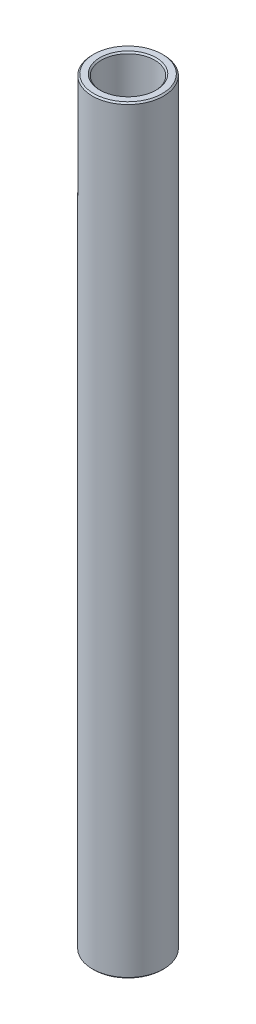
ISO-10303-21;
HEADER;
FILE_DESCRIPTION(('STEP AP214'),'2;1');
FILE_NAME('part.step','',(''),(''),'','','');
FILE_SCHEMA(('AUTOMOTIVE_DESIGN { 1 0 10303 214 1 1 1 1 }'));
ENDSEC;
DATA;
#1=APPLICATION_CONTEXT('core data for automotive mechanical design processes');
#2=APPLICATION_PROTOCOL_DEFINITION('international standard','automotive_design',2000,#1);
#3=PRODUCT_CONTEXT('',#1,'mechanical');
#4=PRODUCT('Part','Part','',(#3));
#5=PRODUCT_RELATED_PRODUCT_CATEGORY('part','',(#4));
#6=PRODUCT_DEFINITION_FORMATION('','',#4);
#7=PRODUCT_DEFINITION_CONTEXT('part definition',#1,'design');
#8=PRODUCT_DEFINITION('design','',#6,#7);
#9=PRODUCT_DEFINITION_SHAPE('','',#8);
#10=(LENGTH_UNIT() NAMED_UNIT(*) SI_UNIT(.MILLI.,.METRE.));
#11=(NAMED_UNIT(*) PLANE_ANGLE_UNIT() SI_UNIT($,.RADIAN.));
#12=(NAMED_UNIT(*) SI_UNIT($,.STERADIAN.) SOLID_ANGLE_UNIT());
#13=UNCERTAINTY_MEASURE_WITH_UNIT(LENGTH_MEASURE(1.E-05),#10,'distance_accuracy_value','');
#14=(GEOMETRIC_REPRESENTATION_CONTEXT(3) GLOBAL_UNCERTAINTY_ASSIGNED_CONTEXT((#13)) GLOBAL_UNIT_ASSIGNED_CONTEXT((#10,
#11,#12)) REPRESENTATION_CONTEXT('',''));
#15=CARTESIAN_POINT('',(0.,0.,0.));
#16=DIRECTION('',(0.,0.,1.));
#17=DIRECTION('',(1.,0.,0.));
#18=AXIS2_PLACEMENT_3D('',#15,#16,#17);
#19=CARTESIAN_POINT('',(6.35000000000029,70.6436949648132,0.));
#20=DIRECTION('',(-1.0081291598624E-12,-1.,0.));
#21=DIRECTION('',(1.,-1.0081291598624E-12,0.));
#22=AXIS2_PLACEMENT_3D('',#19,#20,#21);
#23=PLANE('',#22);
#24=CARTESIAN_POINT('',(9.60243024769503E-12,70.6436949648196,0.));
#25=DIRECTION('',(-1.0081291598624E-12,-1.,0.));
#26=DIRECTION('',(1.,-1.0081291598624E-12,0.));
#27=AXIS2_PLACEMENT_3D('',#24,#25,#26);
#28=CIRCLE('',#27,5.01649999998959);
#29=CARTESIAN_POINT('',(5.01649999999919,70.6436949648146,0.));
#30=VERTEX_POINT('',#29);
#31=EDGE_CURVE('E10',#30,#30,#28,.F.);
#32=ORIENTED_EDGE('',*,*,#31,.T.);
#33=EDGE_LOOP('',(#32));
#34=FACE_BOUND('',#33,.T.);
#35=CARTESIAN_POINT('',(9.60243024769503E-12,70.6436949648196,0.));
#36=DIRECTION('',(-1.0081291598624E-12,-1.,0.));
#37=DIRECTION('',(1.,-1.0081291598624E-12,0.));
#38=AXIS2_PLACEMENT_3D('',#35,#36,#37);
#39=CIRCLE('',#38,6.09599999998992);
#40=CARTESIAN_POINT('',(6.09599999999952,70.6436949648135,0.));
#41=VERTEX_POINT('',#40);
#42=EDGE_CURVE('E37',#41,#41,#39,.T.);
#43=ORIENTED_EDGE('',*,*,#42,.T.);
#44=EDGE_LOOP('',(#43));
#45=FACE_BOUND('',#44,.T.);
#46=ADVANCED_FACE('F30',(#34,#45),#23,.T.);
#47=CARTESIAN_POINT('',(0.,61.118694964814,0.));
#48=DIRECTION('',(-1.0081291598624E-12,-1.,0.));
#49=DIRECTION('',(1.,-1.0081291598624E-12,0.));
#50=AXIS2_PLACEMENT_3D('',#47,#48,#49);
#51=CYLINDRICAL_SURFACE('',#50,4.76249999992219);
#52=CARTESIAN_POINT('',(1.45780895210418E-10,205.724069964894,0.));
#53=DIRECTION('',(1.0081291598624E-12,1.,0.));
#54=DIRECTION('',(-1.,1.0081291598624E-12,0.));
#55=AXIS2_PLACEMENT_3D('',#52,#53,#54);
#56=CIRCLE('',#55,4.76249999992219);
#57=CARTESIAN_POINT('',(-4.76249999977641,205.724069964899,0.));
#58=VERTEX_POINT('',#57);
#59=EDGE_CURVE('E41',#58,#58,#56,.T.);
#60=ORIENTED_EDGE('',*,*,#59,.T.);
#61=EDGE_LOOP('',(#60));
#62=FACE_BOUND('',#61,.T.);
#63=CARTESIAN_POINT('',(9.85849505436801E-12,70.897694964887,0.));
#64=DIRECTION('',(-1.0081291598624E-12,-1.,0.));
#65=DIRECTION('',(1.,-1.0081291598624E-12,0.));
#66=AXIS2_PLACEMENT_3D('',#63,#64,#65);
#67=CIRCLE('',#66,4.76249999992219);
#68=CARTESIAN_POINT('',(4.76249999993205,70.8976949648822,0.));
#69=VERTEX_POINT('',#68);
#70=EDGE_CURVE('E45',#69,#69,#67,.T.);
#71=ORIENTED_EDGE('',*,*,#70,.T.);
#72=EDGE_LOOP('',(#71));
#73=FACE_BOUND('',#72,.T.);
#74=ADVANCED_FACE('F74',(#62,#73),#51,.F.);
#75=CARTESIAN_POINT('',(4.76250000000001,205.978069964822,0.));
#76=DIRECTION('',(1.0081291598624E-12,1.,0.));
#77=DIRECTION('',(-1.,1.0081291598624E-12,0.));
#78=AXIS2_PLACEMENT_3D('',#75,#76,#77);
#79=PLANE('',#78);
#80=CARTESIAN_POINT('',(1.46036960016955E-10,205.978069964827,0.));
#81=DIRECTION('',(1.0081291598624E-12,1.,0.));
#82=DIRECTION('',(-1.,1.0081291598624E-12,0.));
#83=AXIS2_PLACEMENT_3D('',#80,#81,#82);
#84=CIRCLE('',#83,6.09599999985502);
#85=CARTESIAN_POINT('',(-6.09599999970898,205.978069964833,0.));
#86=VERTEX_POINT('',#85);
#87=EDGE_CURVE('E50',#86,#86,#84,.T.);
#88=ORIENTED_EDGE('',*,*,#87,.T.);
#89=EDGE_LOOP('',(#88));
#90=FACE_BOUND('',#89,.T.);
#91=CARTESIAN_POINT('',(1.46036960016955E-10,205.978069964827,0.));
#92=DIRECTION('',(1.0081291598624E-12,1.,0.));
#93=DIRECTION('',(-1.,1.0081291598624E-12,0.));
#94=AXIS2_PLACEMENT_3D('',#91,#92,#93);
#95=CIRCLE('',#94,5.01649999985478);
#96=CARTESIAN_POINT('',(-5.01649999970874,205.978069964832,0.));
#97=VERTEX_POINT('',#96);
#98=EDGE_CURVE('E53',#97,#97,#95,.F.);
#99=ORIENTED_EDGE('',*,*,#98,.T.);
#100=EDGE_LOOP('',(#99));
#101=FACE_BOUND('',#100,.T.);
#102=ADVANCED_FACE('F79',(#90,#101),#79,.T.);
#103=CARTESIAN_POINT('',(0.,61.118694964814,0.));
#104=DIRECTION('',(-1.0081291598624E-12,-1.,0.));
#105=DIRECTION('',(1.,-1.0081291598624E-12,0.));
#106=AXIS2_PLACEMENT_3D('',#103,#104,#105);
#107=CYLINDRICAL_SURFACE('',#106,6.34999999992247);
#108=CARTESIAN_POINT('',(1.45780895210282E-10,205.724069964759,0.));
#109=DIRECTION('',(1.00812915986239E-12,1.,0.));
#110=DIRECTION('',(-1.,1.00812915986239E-12,0.));
#111=AXIS2_PLACEMENT_3D('',#108,#109,#110);
#112=CIRCLE('',#111,6.34999999992247);
#113=CARTESIAN_POINT('',(-6.34999999977668,205.724069964766,0.));
#114=VERTEX_POINT('',#113);
#115=EDGE_CURVE('E56',#114,#114,#112,.F.);
#116=ORIENTED_EDGE('',*,*,#115,.T.);
#117=EDGE_LOOP('',(#116));
#118=FACE_BOUND('',#117,.T.);
#119=CARTESIAN_POINT('',(9.85849505423204E-12,70.8976949647521,0.));
#120=DIRECTION('',(-1.0081291598624E-12,-1.,0.));
#121=DIRECTION('',(1.,-1.0081291598624E-12,0.));
#122=AXIS2_PLACEMENT_3D('',#119,#120,#121);
#123=CIRCLE('',#122,6.34999999992247);
#124=CARTESIAN_POINT('',(6.34999999993232,70.8976949647458,0.));
#125=VERTEX_POINT('',#124);
#126=EDGE_CURVE('E59',#125,#125,#123,.F.);
#127=ORIENTED_EDGE('',*,*,#126,.T.);
#128=EDGE_LOOP('',(#127));
#129=FACE_BOUND('',#128,.T.);
#130=ADVANCED_FACE('F63',(#118,#129),#107,.T.);
#131=CARTESIAN_POINT('',(1.45780895210282E-10,205.724069964759,0.));
#132=DIRECTION('',(-1.00812915986239E-12,-1.,0.));
#133=DIRECTION('',(1.,-1.00812915986239E-12,0.));
#134=AXIS2_PLACEMENT_3D('',#131,#132,#133);
#135=CONICAL_SURFACE('',#134,6.34999999992247,0.785398163397383);
#136=ORIENTED_EDGE('',*,*,#87,.F.);
#137=EDGE_LOOP('',(#136));
#138=FACE_BOUND('',#137,.T.);
#139=ORIENTED_EDGE('',*,*,#115,.F.);
#140=EDGE_LOOP('',(#139));
#141=FACE_BOUND('',#140,.T.);
#142=ADVANCED_FACE('F84',(#138,#141),#135,.T.);
#143=CARTESIAN_POINT('',(1.46036960016955E-10,205.978069964827,0.));
#144=DIRECTION('',(1.0081291598624E-12,1.,0.));
#145=DIRECTION('',(-1.,1.0081291598624E-12,0.));
#146=AXIS2_PLACEMENT_3D('',#143,#144,#145);
#147=CONICAL_SURFACE('',#146,5.01649999985478,0.785398163397442);
#148=ORIENTED_EDGE('',*,*,#59,.F.);
#149=EDGE_LOOP('',(#148));
#150=FACE_BOUND('',#149,.T.);
#151=ORIENTED_EDGE('',*,*,#98,.F.);
#152=EDGE_LOOP('',(#151));
#153=FACE_BOUND('',#152,.T.);
#154=ADVANCED_FACE('F71',(#150,#153),#147,.F.);
#155=CARTESIAN_POINT('',(9.85849505436802E-12,70.897694964887,0.));
#156=DIRECTION('',(-1.0081291598624E-12,-1.,0.));
#157=DIRECTION('',(1.,-1.0081291598624E-12,0.));
#158=AXIS2_PLACEMENT_3D('',#155,#156,#157);
#159=CONICAL_SURFACE('',#158,4.76249999992219,0.785398163397452);
#160=ORIENTED_EDGE('',*,*,#31,.F.);
#161=EDGE_LOOP('',(#160));
#162=FACE_BOUND('',#161,.T.);
#163=ORIENTED_EDGE('',*,*,#70,.F.);
#164=EDGE_LOOP('',(#163));
#165=FACE_BOUND('',#164,.T.);
#166=ADVANCED_FACE('F67',(#162,#165),#159,.F.);
#167=CARTESIAN_POINT('',(9.60243024769503E-12,70.6436949648196,0.));
#168=DIRECTION('',(1.0081291598624E-12,1.,0.));
#169=DIRECTION('',(-1.,1.0081291598624E-12,0.));
#170=AXIS2_PLACEMENT_3D('',#167,#168,#169);
#171=CONICAL_SURFACE('',#170,6.09599999998992,0.785398163397513);
#172=ORIENTED_EDGE('',*,*,#126,.F.);
#173=EDGE_LOOP('',(#172));
#174=FACE_BOUND('',#173,.T.);
#175=ORIENTED_EDGE('',*,*,#42,.F.);
#176=EDGE_LOOP('',(#175));
#177=FACE_BOUND('',#176,.T.);
#178=ADVANCED_FACE('F32',(#174,#177),#171,.T.);
#179=CLOSED_SHELL('',(#46,#74,#102,#130,#142,#154,#166,#178));
#180=MANIFOLD_SOLID_BREP('B2',#179);
#181=ADVANCED_BREP_SHAPE_REPRESENTATION('',(#18,#180),#14);
#182=SHAPE_DEFINITION_REPRESENTATION(#9,#181);
ENDSEC;
END-ISO-10303-21;
